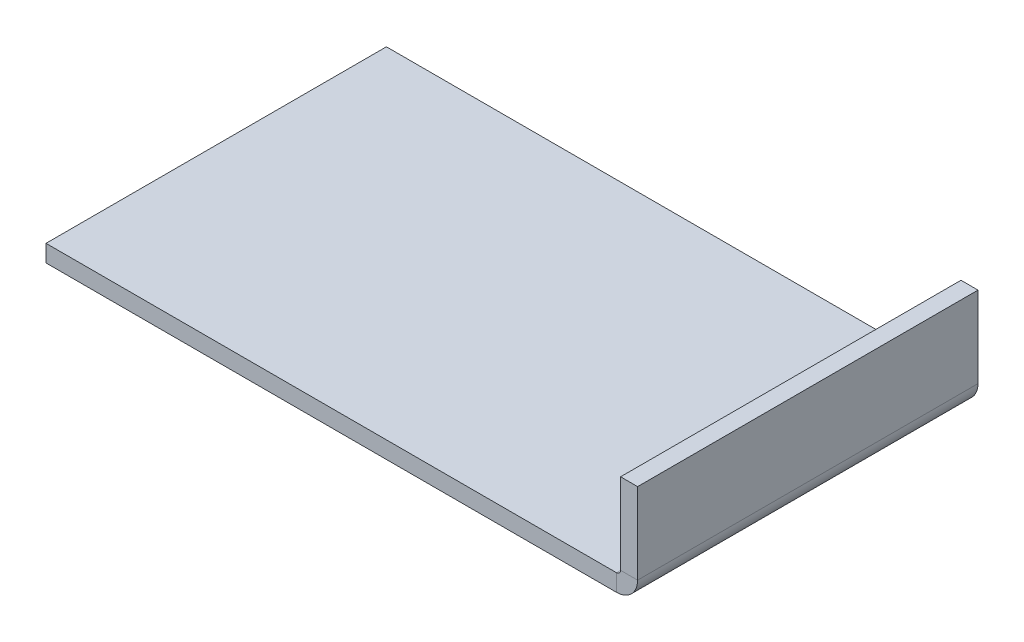
ISO-10303-21;
HEADER;
FILE_DESCRIPTION(('STEP AP214'),'2;1');
FILE_NAME('part.step','',(''),(''),'','','');
FILE_SCHEMA(('AUTOMOTIVE_DESIGN { 1 0 10303 214 1 1 1 1 }'));
ENDSEC;
DATA;
#1=APPLICATION_CONTEXT('core data for automotive mechanical design processes');
#2=APPLICATION_PROTOCOL_DEFINITION('international standard','automotive_design',2000,#1);
#3=PRODUCT_CONTEXT('',#1,'mechanical');
#4=PRODUCT('Part','Part','',(#3));
#5=PRODUCT_RELATED_PRODUCT_CATEGORY('part','',(#4));
#6=PRODUCT_DEFINITION_FORMATION('','',#4);
#7=PRODUCT_DEFINITION_CONTEXT('part definition',#1,'design');
#8=PRODUCT_DEFINITION('design','',#6,#7);
#9=PRODUCT_DEFINITION_SHAPE('','',#8);
#10=(LENGTH_UNIT() NAMED_UNIT(*) SI_UNIT(.MILLI.,.METRE.));
#11=(NAMED_UNIT(*) PLANE_ANGLE_UNIT() SI_UNIT($,.RADIAN.));
#12=(NAMED_UNIT(*) SI_UNIT($,.STERADIAN.) SOLID_ANGLE_UNIT());
#13=UNCERTAINTY_MEASURE_WITH_UNIT(LENGTH_MEASURE(1.E-05),#10,'distance_accuracy_value','');
#14=(GEOMETRIC_REPRESENTATION_CONTEXT(3) GLOBAL_UNCERTAINTY_ASSIGNED_CONTEXT((#13)) GLOBAL_UNIT_ASSIGNED_CONTEXT((#10,
#11,#12)) REPRESENTATION_CONTEXT('',''));
#15=CARTESIAN_POINT('',(0.,0.,0.));
#16=DIRECTION('',(0.,0.,1.));
#17=DIRECTION('',(1.,0.,0.));
#18=AXIS2_PLACEMENT_3D('',#15,#16,#17);
#19=CARTESIAN_POINT('',(0.,3.175,-63.5));
#20=DIRECTION('',(0.,0.,1.));
#21=DIRECTION('',(-1.,0.,0.));
#22=AXIS2_PLACEMENT_3D('',#19,#20,#21);
#23=PLANE('',#22);
#24=DIRECTION('',(0.,1.,0.));
#25=VECTOR('',#24,1.);
#26=CARTESIAN_POINT('',(106.426,3.175,-63.5));
#27=LINE('',#26,#25);
#28=CARTESIAN_POINT('',(106.426,0.,-63.5));
#29=VERTEX_POINT('',#28);
#30=CARTESIAN_POINT('',(106.426,3.175,-63.5));
#31=VERTEX_POINT('',#30);
#32=EDGE_CURVE('E67',#29,#31,#27,.T.);
#33=ORIENTED_EDGE('',*,*,#32,.F.);
#34=DIRECTION('',(1.,0.,0.));
#35=VECTOR('',#34,1.);
#36=CARTESIAN_POINT('',(0.,0.,-63.5));
#37=LINE('',#36,#35);
#38=CARTESIAN_POINT('',(0.,0.,-63.5));
#39=VERTEX_POINT('',#38);
#40=EDGE_CURVE('E100',#29,#39,#37,.F.);
#41=ORIENTED_EDGE('',*,*,#40,.T.);
#42=DIRECTION('',(0.,1.,0.));
#43=VECTOR('',#42,1.);
#44=CARTESIAN_POINT('',(0.,3.175,-63.5));
#45=LINE('',#44,#43);
#46=CARTESIAN_POINT('',(0.,3.175,-63.5));
#47=VERTEX_POINT('',#46);
#48=EDGE_CURVE('E75',#39,#47,#45,.T.);
#49=ORIENTED_EDGE('',*,*,#48,.T.);
#50=DIRECTION('',(-1.,0.,0.));
#51=VECTOR('',#50,1.);
#52=CARTESIAN_POINT('',(0.,3.175,-63.5));
#53=LINE('',#52,#51);
#54=EDGE_CURVE('E137',#31,#47,#53,.T.);
#55=ORIENTED_EDGE('',*,*,#54,.F.);
#56=EDGE_LOOP('',(#33,#41,#49,#55));
#57=FACE_BOUND('',#56,.T.);
#58=ADVANCED_FACE('F57',(#57),#23,.F.);
#59=CARTESIAN_POINT('',(0.,3.175,0.));
#60=DIRECTION('',(1.,0.,0.));
#61=DIRECTION('',(0.,0.,1.));
#62=AXIS2_PLACEMENT_3D('',#59,#60,#61);
#63=PLANE('',#62);
#64=ORIENTED_EDGE('',*,*,#48,.F.);
#65=DIRECTION('',(0.,0.,-1.));
#66=VECTOR('',#65,1.);
#67=CARTESIAN_POINT('',(0.,0.,-63.5));
#68=LINE('',#67,#66);
#69=CARTESIAN_POINT('',(0.,0.,0.));
#70=VERTEX_POINT('',#69);
#71=EDGE_CURVE('E153',#39,#70,#68,.F.);
#72=ORIENTED_EDGE('',*,*,#71,.T.);
#73=DIRECTION('',(0.,1.,0.));
#74=VECTOR('',#73,1.);
#75=CARTESIAN_POINT('',(0.,3.175,0.));
#76=LINE('',#75,#74);
#77=CARTESIAN_POINT('',(0.,3.175,0.));
#78=VERTEX_POINT('',#77);
#79=EDGE_CURVE('E61',#70,#78,#76,.T.);
#80=ORIENTED_EDGE('',*,*,#79,.T.);
#81=DIRECTION('',(0.,0.,1.));
#82=VECTOR('',#81,1.);
#83=CARTESIAN_POINT('',(0.,3.175,0.));
#84=LINE('',#83,#82);
#85=EDGE_CURVE('E127',#47,#78,#84,.T.);
#86=ORIENTED_EDGE('',*,*,#85,.F.);
#87=EDGE_LOOP('',(#64,#72,#80,#86));
#88=FACE_BOUND('',#87,.T.);
#89=ADVANCED_FACE('F235',(#88),#63,.F.);
#90=CARTESIAN_POINT('',(0.,3.175,0.));
#91=DIRECTION('',(0.,0.,-1.));
#92=DIRECTION('',(1.,0.,0.));
#93=AXIS2_PLACEMENT_3D('',#90,#91,#92);
#94=PLANE('',#93);
#95=DIRECTION('',(1.,0.,0.));
#96=VECTOR('',#95,1.);
#97=CARTESIAN_POINT('',(0.,0.,0.));
#98=LINE('',#97,#96);
#99=CARTESIAN_POINT('',(106.426,0.,0.));
#100=VERTEX_POINT('',#99);
#101=EDGE_CURVE('E116',#70,#100,#98,.T.);
#102=ORIENTED_EDGE('',*,*,#101,.T.);
#103=DIRECTION('',(0.,1.,0.));
#104=VECTOR('',#103,1.);
#105=CARTESIAN_POINT('',(106.426,3.175,0.));
#106=LINE('',#105,#104);
#107=CARTESIAN_POINT('',(106.426,3.175,0.));
#108=VERTEX_POINT('',#107);
#109=EDGE_CURVE('E13',#100,#108,#106,.T.);
#110=ORIENTED_EDGE('',*,*,#109,.T.);
#111=DIRECTION('',(1.,0.,0.));
#112=VECTOR('',#111,1.);
#113=CARTESIAN_POINT('',(0.,3.175,0.));
#114=LINE('',#113,#112);
#115=EDGE_CURVE('E115',#78,#108,#114,.T.);
#116=ORIENTED_EDGE('',*,*,#115,.F.);
#117=ORIENTED_EDGE('',*,*,#79,.F.);
#118=EDGE_LOOP('',(#102,#110,#116,#117));
#119=FACE_BOUND('',#118,.T.);
#120=ADVANCED_FACE('F59',(#119),#94,.F.);
#121=CARTESIAN_POINT('',(0.,3.175,-63.5));
#122=DIRECTION('',(0.,-1.,0.));
#123=DIRECTION('',(0.,0.,-1.));
#124=AXIS2_PLACEMENT_3D('',#121,#122,#123);
#125=PLANE('',#124);
#126=ORIENTED_EDGE('',*,*,#85,.T.);
#127=ORIENTED_EDGE('',*,*,#115,.T.);
#128=DIRECTION('',(0.,0.,-1.));
#129=VECTOR('',#128,1.);
#130=CARTESIAN_POINT('',(106.426,3.175,0.));
#131=LINE('',#130,#129);
#132=EDGE_CURVE('E126',#108,#31,#131,.T.);
#133=ORIENTED_EDGE('',*,*,#132,.T.);
#134=ORIENTED_EDGE('',*,*,#54,.T.);
#135=EDGE_LOOP('',(#126,#127,#133,#134));
#136=FACE_BOUND('',#135,.T.);
#137=ADVANCED_FACE('F124',(#136),#125,.F.);
#138=CARTESIAN_POINT('',(0.,0.,-63.5));
#139=DIRECTION('',(0.,-1.,0.));
#140=DIRECTION('',(0.,0.,-1.));
#141=AXIS2_PLACEMENT_3D('',#138,#139,#140);
#142=PLANE('',#141);
#143=ORIENTED_EDGE('',*,*,#71,.F.);
#144=ORIENTED_EDGE('',*,*,#40,.F.);
#145=DIRECTION('',(0.,0.,-1.));
#146=VECTOR('',#145,1.);
#147=CARTESIAN_POINT('',(106.426,0.,-63.5));
#148=LINE('',#147,#146);
#149=EDGE_CURVE('E90',#100,#29,#148,.T.);
#150=ORIENTED_EDGE('',*,*,#149,.F.);
#151=ORIENTED_EDGE('',*,*,#101,.F.);
#152=EDGE_LOOP('',(#143,#144,#150,#151));
#153=FACE_BOUND('',#152,.T.);
#154=ADVANCED_FACE('F242',(#153),#142,.T.);
#155=CARTESIAN_POINT('',(106.426,3.937,0.));
#156=DIRECTION('',(0.,0.,1.));
#157=DIRECTION('',(1.,0.,0.));
#158=AXIS2_PLACEMENT_3D('',#155,#156,#157);
#159=PLANE('',#158);
#160=DIRECTION('',(-1.,0.,0.));
#161=VECTOR('',#160,1.);
#162=CARTESIAN_POINT('',(110.363,3.93699999999998,0.));
#163=LINE('',#162,#161);
#164=CARTESIAN_POINT('',(107.188,3.937,0.));
#165=VERTEX_POINT('',#164);
#166=CARTESIAN_POINT('',(110.363,3.93699999999998,0.));
#167=VERTEX_POINT('',#166);
#168=EDGE_CURVE('E141',#165,#167,#163,.F.);
#169=ORIENTED_EDGE('',*,*,#168,.F.);
#170=CARTESIAN_POINT('',(106.426,3.937,0.));
#171=DIRECTION('',(0.,0.,-1.));
#172=DIRECTION('',(-1.,0.,0.));
#173=AXIS2_PLACEMENT_3D('',#170,#171,#172);
#174=CIRCLE('',#173,0.761999999999999);
#175=EDGE_CURVE('E133',#108,#165,#174,.F.);
#176=ORIENTED_EDGE('',*,*,#175,.F.);
#177=ORIENTED_EDGE('',*,*,#109,.F.);
#178=CARTESIAN_POINT('',(106.426,3.937,0.));
#179=DIRECTION('',(0.,0.,-1.));
#180=DIRECTION('',(-1.,0.,0.));
#181=AXIS2_PLACEMENT_3D('',#178,#179,#180);
#182=CIRCLE('',#181,3.937);
#183=EDGE_CURVE('E145',#100,#167,#182,.F.);
#184=ORIENTED_EDGE('',*,*,#183,.T.);
#185=EDGE_LOOP('',(#169,#176,#177,#184));
#186=FACE_BOUND('',#185,.T.);
#187=ADVANCED_FACE('F139',(#186),#159,.T.);
#188=CARTESIAN_POINT('',(106.426,3.937,-63.5));
#189=DIRECTION('',(0.,0.,1.));
#190=DIRECTION('',(1.,0.,0.));
#191=AXIS2_PLACEMENT_3D('',#188,#189,#190);
#192=PLANE('',#191);
#193=CARTESIAN_POINT('',(106.426,3.937,-63.5));
#194=DIRECTION('',(0.,0.,-1.));
#195=DIRECTION('',(-1.,0.,0.));
#196=AXIS2_PLACEMENT_3D('',#193,#194,#195);
#197=CIRCLE('',#196,0.761999999999999);
#198=CARTESIAN_POINT('',(107.188,3.937,-63.5));
#199=VERTEX_POINT('',#198);
#200=EDGE_CURVE('E136',#199,#31,#197,.T.);
#201=ORIENTED_EDGE('',*,*,#200,.F.);
#202=DIRECTION('',(-1.,0.,0.));
#203=VECTOR('',#202,1.);
#204=CARTESIAN_POINT('',(107.188,3.937,-63.5));
#205=LINE('',#204,#203);
#206=CARTESIAN_POINT('',(110.363,3.93699999999999,-63.5));
#207=VERTEX_POINT('',#206);
#208=EDGE_CURVE('E175',#199,#207,#205,.F.);
#209=ORIENTED_EDGE('',*,*,#208,.T.);
#210=CARTESIAN_POINT('',(106.426,3.937,-63.5));
#211=DIRECTION('',(0.,0.,-1.));
#212=DIRECTION('',(-1.,0.,0.));
#213=AXIS2_PLACEMENT_3D('',#210,#211,#212);
#214=CIRCLE('',#213,3.937);
#215=EDGE_CURVE('E142',#207,#29,#214,.T.);
#216=ORIENTED_EDGE('',*,*,#215,.T.);
#217=ORIENTED_EDGE('',*,*,#32,.T.);
#218=EDGE_LOOP('',(#201,#209,#216,#217));
#219=FACE_BOUND('',#218,.T.);
#220=ADVANCED_FACE('F162',(#219),#192,.F.);
#221=CARTESIAN_POINT('',(106.426,3.937,-63.5));
#222=DIRECTION('',(0.,0.,-1.));
#223=DIRECTION('',(1.,0.,0.));
#224=AXIS2_PLACEMENT_3D('',#221,#222,#223);
#225=CYLINDRICAL_SURFACE('',#224,3.937);
#226=ORIENTED_EDGE('',*,*,#149,.T.);
#227=ORIENTED_EDGE('',*,*,#215,.F.);
#228=DIRECTION('',(0.,0.,-1.));
#229=VECTOR('',#228,1.);
#230=CARTESIAN_POINT('',(110.363,3.93699999999998,0.));
#231=LINE('',#230,#229);
#232=EDGE_CURVE('E170',#207,#167,#231,.F.);
#233=ORIENTED_EDGE('',*,*,#232,.T.);
#234=ORIENTED_EDGE('',*,*,#183,.F.);
#235=EDGE_LOOP('',(#226,#227,#233,#234));
#236=FACE_BOUND('',#235,.T.);
#237=ADVANCED_FACE('F167',(#236),#225,.T.);
#238=CARTESIAN_POINT('',(106.426,3.937,-63.5));
#239=DIRECTION('',(0.,0.,-1.));
#240=DIRECTION('',(1.,0.,0.));
#241=AXIS2_PLACEMENT_3D('',#238,#239,#240);
#242=CYLINDRICAL_SURFACE('',#241,0.761999999999999);
#243=ORIENTED_EDGE('',*,*,#132,.F.);
#244=ORIENTED_EDGE('',*,*,#175,.T.);
#245=DIRECTION('',(0.,0.,-1.));
#246=VECTOR('',#245,1.);
#247=CARTESIAN_POINT('',(107.188,3.937,0.));
#248=LINE('',#247,#246);
#249=EDGE_CURVE('E173',#165,#199,#248,.T.);
#250=ORIENTED_EDGE('',*,*,#249,.T.);
#251=ORIENTED_EDGE('',*,*,#200,.T.);
#252=EDGE_LOOP('',(#243,#244,#250,#251));
#253=FACE_BOUND('',#252,.T.);
#254=ADVANCED_FACE('F132',(#253),#242,.F.);
#255=CARTESIAN_POINT('',(110.363,3.17499999999999,0.));
#256=DIRECTION('',(0.,0.,-1.));
#257=DIRECTION('',(-1.,0.,0.));
#258=AXIS2_PLACEMENT_3D('',#255,#256,#257);
#259=PLANE('',#258);
#260=ORIENTED_EDGE('',*,*,#168,.T.);
#261=DIRECTION('',(0.,-1.,0.));
#262=VECTOR('',#261,1.);
#263=CARTESIAN_POINT('',(110.363,19.05,0.));
#264=LINE('',#263,#262);
#265=CARTESIAN_POINT('',(110.363,19.05,0.));
#266=VERTEX_POINT('',#265);
#267=EDGE_CURVE('E187',#266,#167,#264,.T.);
#268=ORIENTED_EDGE('',*,*,#267,.F.);
#269=DIRECTION('',(-1.,0.,0.));
#270=VECTOR('',#269,1.);
#271=CARTESIAN_POINT('',(110.363,19.05,0.));
#272=LINE('',#271,#270);
#273=CARTESIAN_POINT('',(107.188,19.05,0.));
#274=VERTEX_POINT('',#273);
#275=EDGE_CURVE('E196',#266,#274,#272,.T.);
#276=ORIENTED_EDGE('',*,*,#275,.T.);
#277=DIRECTION('',(0.,1.,0.));
#278=VECTOR('',#277,1.);
#279=CARTESIAN_POINT('',(107.188,3.175,0.));
#280=LINE('',#279,#278);
#281=EDGE_CURVE('E178',#274,#165,#280,.F.);
#282=ORIENTED_EDGE('',*,*,#281,.T.);
#283=EDGE_LOOP('',(#260,#268,#276,#282));
#284=FACE_BOUND('',#283,.T.);
#285=ADVANCED_FACE('F218',(#284),#259,.F.);
#286=CARTESIAN_POINT('',(110.363,19.05,-63.5));
#287=DIRECTION('',(0.,0.,1.));
#288=DIRECTION('',(1.,0.,0.));
#289=AXIS2_PLACEMENT_3D('',#286,#287,#288);
#290=PLANE('',#289);
#291=ORIENTED_EDGE('',*,*,#208,.F.);
#292=DIRECTION('',(0.,-1.,0.));
#293=VECTOR('',#292,1.);
#294=CARTESIAN_POINT('',(107.188,19.05,-63.5));
#295=LINE('',#294,#293);
#296=CARTESIAN_POINT('',(107.188,19.05,-63.5));
#297=VERTEX_POINT('',#296);
#298=EDGE_CURVE('E181',#199,#297,#295,.F.);
#299=ORIENTED_EDGE('',*,*,#298,.T.);
#300=DIRECTION('',(-1.,0.,0.));
#301=VECTOR('',#300,1.);
#302=CARTESIAN_POINT('',(110.363,19.05,-63.5));
#303=LINE('',#302,#301);
#304=CARTESIAN_POINT('',(110.363,19.05,-63.5));
#305=VERTEX_POINT('',#304);
#306=EDGE_CURVE('E147',#305,#297,#303,.T.);
#307=ORIENTED_EDGE('',*,*,#306,.F.);
#308=DIRECTION('',(0.,1.,0.));
#309=VECTOR('',#308,1.);
#310=CARTESIAN_POINT('',(110.363,19.05,-63.5));
#311=LINE('',#310,#309);
#312=EDGE_CURVE('E190',#207,#305,#311,.T.);
#313=ORIENTED_EDGE('',*,*,#312,.F.);
#314=EDGE_LOOP('',(#291,#299,#307,#313));
#315=FACE_BOUND('',#314,.T.);
#316=ADVANCED_FACE('F224',(#315),#290,.F.);
#317=CARTESIAN_POINT('',(110.363,19.05,0.));
#318=DIRECTION('',(-1.,0.,0.));
#319=DIRECTION('',(0.,-1.,0.));
#320=AXIS2_PLACEMENT_3D('',#317,#318,#319);
#321=PLANE('',#320);
#322=ORIENTED_EDGE('',*,*,#232,.F.);
#323=ORIENTED_EDGE('',*,*,#312,.T.);
#324=DIRECTION('',(0.,0.,1.));
#325=VECTOR('',#324,1.);
#326=CARTESIAN_POINT('',(110.363,19.05,0.));
#327=LINE('',#326,#325);
#328=EDGE_CURVE('E193',#305,#266,#327,.T.);
#329=ORIENTED_EDGE('',*,*,#328,.T.);
#330=ORIENTED_EDGE('',*,*,#267,.T.);
#331=EDGE_LOOP('',(#322,#323,#329,#330));
#332=FACE_BOUND('',#331,.T.);
#333=ADVANCED_FACE('F223',(#332),#321,.F.);
#334=CARTESIAN_POINT('',(107.188,19.05,0.));
#335=DIRECTION('',(-1.,0.,0.));
#336=DIRECTION('',(0.,-1.,0.));
#337=AXIS2_PLACEMENT_3D('',#334,#335,#336);
#338=PLANE('',#337);
#339=ORIENTED_EDGE('',*,*,#298,.F.);
#340=ORIENTED_EDGE('',*,*,#249,.F.);
#341=ORIENTED_EDGE('',*,*,#281,.F.);
#342=DIRECTION('',(0.,0.,-1.));
#343=VECTOR('',#342,1.);
#344=CARTESIAN_POINT('',(107.188,19.05,0.));
#345=LINE('',#344,#343);
#346=EDGE_CURVE('E184',#297,#274,#345,.F.);
#347=ORIENTED_EDGE('',*,*,#346,.F.);
#348=EDGE_LOOP('',(#339,#340,#341,#347));
#349=FACE_BOUND('',#348,.T.);
#350=ADVANCED_FACE('F215',(#349),#338,.T.);
#351=CARTESIAN_POINT('',(110.363,19.05,0.));
#352=DIRECTION('',(0.,-1.,0.));
#353=DIRECTION('',(1.,0.,0.));
#354=AXIS2_PLACEMENT_3D('',#351,#352,#353);
#355=PLANE('',#354);
#356=ORIENTED_EDGE('',*,*,#346,.T.);
#357=ORIENTED_EDGE('',*,*,#275,.F.);
#358=ORIENTED_EDGE('',*,*,#328,.F.);
#359=ORIENTED_EDGE('',*,*,#306,.T.);
#360=EDGE_LOOP('',(#356,#357,#358,#359));
#361=FACE_BOUND('',#360,.T.);
#362=ADVANCED_FACE('F205',(#361),#355,.F.);
#363=CLOSED_SHELL('',(#58,#89,#120,#137,#154,#187,#220,#237,#254,#285,#316,#333,#350,#362));
#364=MANIFOLD_SOLID_BREP('B2',#363);
#365=ADVANCED_BREP_SHAPE_REPRESENTATION('',(#18,#364),#14);
#366=SHAPE_DEFINITION_REPRESENTATION(#9,#365);
ENDSEC;
END-ISO-10303-21;
